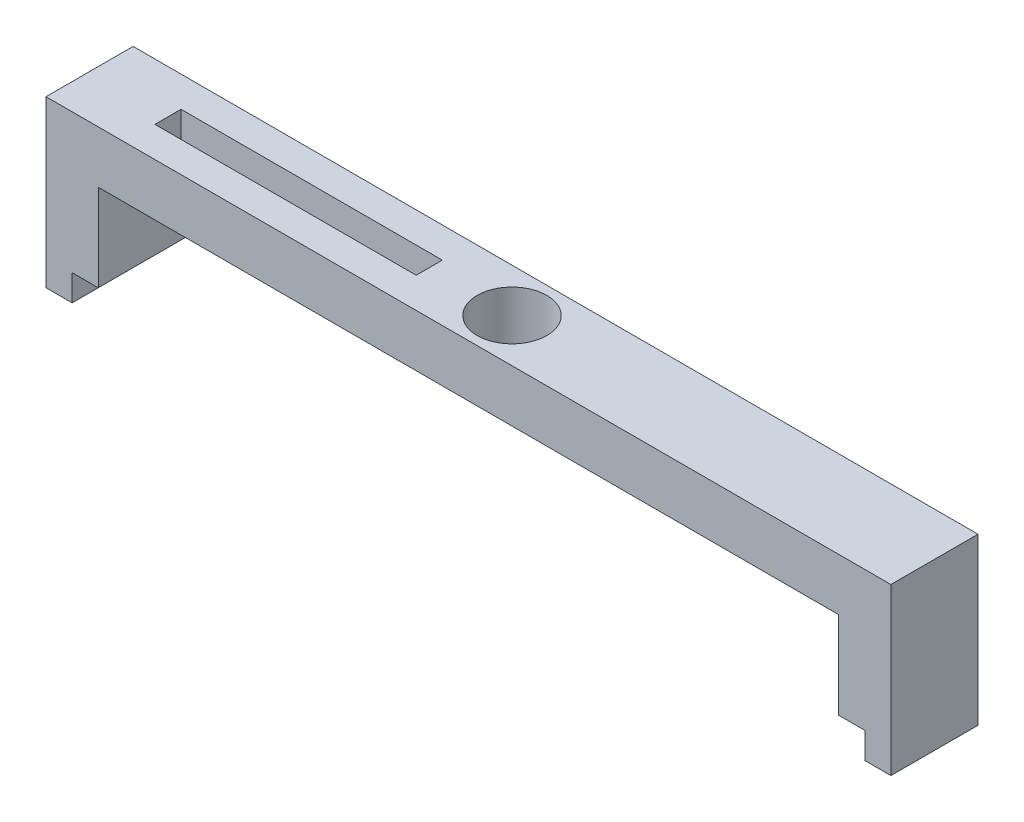
ISO-10303-21;
HEADER;
FILE_DESCRIPTION(('STEP AP214'),'2;1');
FILE_NAME('part.step','',(''),(''),'','','');
FILE_SCHEMA(('AUTOMOTIVE_DESIGN { 1 0 10303 214 1 1 1 1 }'));
ENDSEC;
DATA;
#1=APPLICATION_CONTEXT('core data for automotive mechanical design processes');
#2=APPLICATION_PROTOCOL_DEFINITION('international standard','automotive_design',2000,#1);
#3=PRODUCT_CONTEXT('',#1,'mechanical');
#4=PRODUCT('Part','Part','',(#3));
#5=PRODUCT_RELATED_PRODUCT_CATEGORY('part','',(#4));
#6=PRODUCT_DEFINITION_FORMATION('','',#4);
#7=PRODUCT_DEFINITION_CONTEXT('part definition',#1,'design');
#8=PRODUCT_DEFINITION('design','',#6,#7);
#9=PRODUCT_DEFINITION_SHAPE('','',#8);
#10=(LENGTH_UNIT() NAMED_UNIT(*) SI_UNIT(.MILLI.,.METRE.));
#11=(NAMED_UNIT(*) PLANE_ANGLE_UNIT() SI_UNIT($,.RADIAN.));
#12=(NAMED_UNIT(*) SI_UNIT($,.STERADIAN.) SOLID_ANGLE_UNIT());
#13=UNCERTAINTY_MEASURE_WITH_UNIT(LENGTH_MEASURE(1.E-05),#10,'distance_accuracy_value','');
#14=(GEOMETRIC_REPRESENTATION_CONTEXT(3) GLOBAL_UNCERTAINTY_ASSIGNED_CONTEXT((#13)) GLOBAL_UNIT_ASSIGNED_CONTEXT((#10,
#11,#12)) REPRESENTATION_CONTEXT('',''));
#15=CARTESIAN_POINT('',(0.,0.,0.));
#16=DIRECTION('',(0.,0.,1.));
#17=DIRECTION('',(1.,0.,0.));
#18=AXIS2_PLACEMENT_3D('',#15,#16,#17);
#19=CARTESIAN_POINT('',(-49.4121405750799,-10.,10.));
#20=DIRECTION('',(0.,1.,0.));
#21=DIRECTION('',(0.,0.,1.));
#22=AXIS2_PLACEMENT_3D('',#19,#20,#21);
#23=PLANE('',#22);
#24=DIRECTION('',(1.,0.,0.));
#25=VECTOR('',#24,1.);
#26=CARTESIAN_POINT('',(-49.4121405750799,-10.,0.));
#27=LINE('',#26,#25);
#28=CARTESIAN_POINT('',(-49.4121405750799,-10.,0.));
#29=VERTEX_POINT('',#28);
#30=CARTESIAN_POINT('',(-46.4121405750799,-10.,0.));
#31=VERTEX_POINT('',#30);
#32=EDGE_CURVE('E205',#29,#31,#27,.T.);
#33=ORIENTED_EDGE('',*,*,#32,.T.);
#34=DIRECTION('',(0.,0.,-1.));
#35=VECTOR('',#34,1.);
#36=CARTESIAN_POINT('',(-46.4121405750799,-10.,10.));
#37=LINE('',#36,#35);
#38=CARTESIAN_POINT('',(-46.4121405750799,-10.,10.));
#39=VERTEX_POINT('',#38);
#40=EDGE_CURVE('E11',#39,#31,#37,.T.);
#41=ORIENTED_EDGE('',*,*,#40,.F.);
#42=DIRECTION('',(1.,0.,0.));
#43=VECTOR('',#42,1.);
#44=CARTESIAN_POINT('',(-49.4121405750799,-10.,10.));
#45=LINE('',#44,#43);
#46=CARTESIAN_POINT('',(-49.4121405750799,-10.,10.));
#47=VERTEX_POINT('',#46);
#48=EDGE_CURVE('E206',#47,#39,#45,.T.);
#49=ORIENTED_EDGE('',*,*,#48,.F.);
#50=DIRECTION('',(0.,0.,-1.));
#51=VECTOR('',#50,1.);
#52=CARTESIAN_POINT('',(-49.4121405750799,-10.,10.));
#53=LINE('',#52,#51);
#54=EDGE_CURVE('E244',#47,#29,#53,.T.);
#55=ORIENTED_EDGE('',*,*,#54,.T.);
#56=EDGE_LOOP('',(#33,#41,#49,#55));
#57=FACE_BOUND('',#56,.T.);
#58=ADVANCED_FACE('F39',(#57),#23,.F.);
#59=CARTESIAN_POINT('',(-46.4121405750799,-10.,10.));
#60=DIRECTION('',(-1.,0.,0.));
#61=DIRECTION('',(0.,0.,1.));
#62=AXIS2_PLACEMENT_3D('',#59,#60,#61);
#63=PLANE('',#62);
#64=DIRECTION('',(0.,1.,0.));
#65=VECTOR('',#64,1.);
#66=CARTESIAN_POINT('',(-46.4121405750799,-10.,0.));
#67=LINE('',#66,#65);
#68=CARTESIAN_POINT('',(-46.4121405750799,0.,0.));
#69=VERTEX_POINT('',#68);
#70=EDGE_CURVE('E248',#31,#69,#67,.T.);
#71=ORIENTED_EDGE('',*,*,#70,.T.);
#72=DIRECTION('',(0.,0.,-1.));
#73=VECTOR('',#72,1.);
#74=CARTESIAN_POINT('',(-46.4121405750799,0.,10.));
#75=LINE('',#74,#73);
#76=CARTESIAN_POINT('',(-46.4121405750799,0.,10.));
#77=VERTEX_POINT('',#76);
#78=EDGE_CURVE('E47',#77,#69,#75,.T.);
#79=ORIENTED_EDGE('',*,*,#78,.F.);
#80=DIRECTION('',(0.,1.,0.));
#81=VECTOR('',#80,1.);
#82=CARTESIAN_POINT('',(-46.4121405750799,-10.,10.));
#83=LINE('',#82,#81);
#84=EDGE_CURVE('E210',#39,#77,#83,.T.);
#85=ORIENTED_EDGE('',*,*,#84,.F.);
#86=ORIENTED_EDGE('',*,*,#40,.T.);
#87=EDGE_LOOP('',(#71,#79,#85,#86));
#88=FACE_BOUND('',#87,.T.);
#89=ADVANCED_FACE('F327',(#88),#63,.F.);
#90=CARTESIAN_POINT('',(38.5878594249201,0.,10.));
#91=DIRECTION('',(0.,1.,0.));
#92=DIRECTION('',(0.,0.,1.));
#93=AXIS2_PLACEMENT_3D('',#90,#91,#92);
#94=PLANE('',#93);
#95=CARTESIAN_POINT('',(-3.91214057507986,0.,5.));
#96=DIRECTION('',(0.,1.,0.));
#97=DIRECTION('',(0.,0.,1.));
#98=AXIS2_PLACEMENT_3D('',#95,#96,#97);
#99=CIRCLE('',#98,4.);
#100=CARTESIAN_POINT('',(-3.91214057507986,0.,9.));
#101=VERTEX_POINT('',#100);
#102=EDGE_CURVE('E201',#101,#101,#99,.T.);
#103=ORIENTED_EDGE('',*,*,#102,.T.);
#104=EDGE_LOOP('',(#103));
#105=FACE_BOUND('',#104,.T.);
#106=DIRECTION('',(1.,0.,0.));
#107=VECTOR('',#106,1.);
#108=CARTESIAN_POINT('',(38.5878594249201,0.,6.5));
#109=LINE('',#108,#107);
#110=CARTESIAN_POINT('',(-43.4121405750799,0.,6.5));
#111=VERTEX_POINT('',#110);
#112=CARTESIAN_POINT('',(-13.4121405750799,0.,6.5));
#113=VERTEX_POINT('',#112);
#114=EDGE_CURVE('E193',#111,#113,#109,.T.);
#115=ORIENTED_EDGE('',*,*,#114,.T.);
#116=DIRECTION('',(0.,0.,-1.));
#117=VECTOR('',#116,1.);
#118=CARTESIAN_POINT('',(-13.4121405750799,0.,10.));
#119=LINE('',#118,#117);
#120=CARTESIAN_POINT('',(-13.4121405750799,0.,3.5));
#121=VERTEX_POINT('',#120);
#122=EDGE_CURVE('E197',#113,#121,#119,.T.);
#123=ORIENTED_EDGE('',*,*,#122,.T.);
#124=DIRECTION('',(-1.,0.,0.));
#125=VECTOR('',#124,1.);
#126=CARTESIAN_POINT('',(38.5878594249201,0.,3.5));
#127=LINE('',#126,#125);
#128=CARTESIAN_POINT('',(-43.4121405750799,0.,3.5));
#129=VERTEX_POINT('',#128);
#130=EDGE_CURVE('E188',#121,#129,#127,.T.);
#131=ORIENTED_EDGE('',*,*,#130,.T.);
#132=DIRECTION('',(0.,0.,1.));
#133=VECTOR('',#132,1.);
#134=CARTESIAN_POINT('',(-43.4121405750799,0.,10.));
#135=LINE('',#134,#133);
#136=EDGE_CURVE('E158',#129,#111,#135,.T.);
#137=ORIENTED_EDGE('',*,*,#136,.T.);
#138=EDGE_LOOP('',(#115,#123,#131,#137));
#139=FACE_BOUND('',#138,.T.);
#140=DIRECTION('',(1.,0.,0.));
#141=VECTOR('',#140,1.);
#142=CARTESIAN_POINT('',(38.5878594249201,0.,0.));
#143=LINE('',#142,#141);
#144=CARTESIAN_POINT('',(38.5878594249201,0.,0.));
#145=VERTEX_POINT('',#144);
#146=EDGE_CURVE('E252',#69,#145,#143,.T.);
#147=ORIENTED_EDGE('',*,*,#146,.T.);
#148=DIRECTION('',(0.,0.,-1.));
#149=VECTOR('',#148,1.);
#150=CARTESIAN_POINT('',(38.5878594249201,0.,10.));
#151=LINE('',#150,#149);
#152=CARTESIAN_POINT('',(38.5878594249201,0.,10.));
#153=VERTEX_POINT('',#152);
#154=EDGE_CURVE('E316',#153,#145,#151,.T.);
#155=ORIENTED_EDGE('',*,*,#154,.F.);
#156=DIRECTION('',(1.,0.,0.));
#157=VECTOR('',#156,1.);
#158=CARTESIAN_POINT('',(-46.4121405750799,0.,10.));
#159=LINE('',#158,#157);
#160=EDGE_CURVE('E214',#77,#153,#159,.T.);
#161=ORIENTED_EDGE('',*,*,#160,.F.);
#162=ORIENTED_EDGE('',*,*,#78,.T.);
#163=EDGE_LOOP('',(#147,#155,#161,#162));
#164=FACE_BOUND('',#163,.T.);
#165=ADVANCED_FACE('F324',(#105,#139,#164),#94,.F.);
#166=CARTESIAN_POINT('',(38.5878594249201,-10.,10.));
#167=DIRECTION('',(1.,0.,0.));
#168=DIRECTION('',(0.,0.,-1.));
#169=AXIS2_PLACEMENT_3D('',#166,#167,#168);
#170=PLANE('',#169);
#171=DIRECTION('',(0.,-1.,0.));
#172=VECTOR('',#171,1.);
#173=CARTESIAN_POINT('',(38.5878594249201,-10.,0.));
#174=LINE('',#173,#172);
#175=CARTESIAN_POINT('',(38.5878594249201,-10.,0.));
#176=VERTEX_POINT('',#175);
#177=EDGE_CURVE('E255',#145,#176,#174,.T.);
#178=ORIENTED_EDGE('',*,*,#177,.T.);
#179=DIRECTION('',(0.,0.,-1.));
#180=VECTOR('',#179,1.);
#181=CARTESIAN_POINT('',(38.5878594249201,-10.,10.));
#182=LINE('',#181,#180);
#183=CARTESIAN_POINT('',(38.5878594249201,-10.,10.));
#184=VERTEX_POINT('',#183);
#185=EDGE_CURVE('E312',#184,#176,#182,.T.);
#186=ORIENTED_EDGE('',*,*,#185,.F.);
#187=DIRECTION('',(0.,-1.,0.));
#188=VECTOR('',#187,1.);
#189=CARTESIAN_POINT('',(38.5878594249201,-10.,10.));
#190=LINE('',#189,#188);
#191=EDGE_CURVE('E217',#153,#184,#190,.T.);
#192=ORIENTED_EDGE('',*,*,#191,.F.);
#193=ORIENTED_EDGE('',*,*,#154,.T.);
#194=EDGE_LOOP('',(#178,#186,#192,#193));
#195=FACE_BOUND('',#194,.T.);
#196=ADVANCED_FACE('F338',(#195),#170,.F.);
#197=CARTESIAN_POINT('',(38.5878594249201,-10.,10.));
#198=DIRECTION('',(0.,1.,0.));
#199=DIRECTION('',(0.,0.,1.));
#200=AXIS2_PLACEMENT_3D('',#197,#198,#199);
#201=PLANE('',#200);
#202=DIRECTION('',(1.,0.,0.));
#203=VECTOR('',#202,1.);
#204=CARTESIAN_POINT('',(38.5878594249201,-10.,0.));
#205=LINE('',#204,#203);
#206=CARTESIAN_POINT('',(41.5878594249201,-10.,0.));
#207=VERTEX_POINT('',#206);
#208=EDGE_CURVE('E258',#176,#207,#205,.T.);
#209=ORIENTED_EDGE('',*,*,#208,.T.);
#210=DIRECTION('',(0.,0.,-1.));
#211=VECTOR('',#210,1.);
#212=CARTESIAN_POINT('',(41.5878594249201,-10.,10.));
#213=LINE('',#212,#211);
#214=CARTESIAN_POINT('',(41.5878594249201,-10.,10.));
#215=VERTEX_POINT('',#214);
#216=EDGE_CURVE('E308',#215,#207,#213,.T.);
#217=ORIENTED_EDGE('',*,*,#216,.F.);
#218=DIRECTION('',(1.,0.,0.));
#219=VECTOR('',#218,1.);
#220=CARTESIAN_POINT('',(38.5878594249201,-10.,10.));
#221=LINE('',#220,#219);
#222=EDGE_CURVE('E220',#184,#215,#221,.T.);
#223=ORIENTED_EDGE('',*,*,#222,.F.);
#224=ORIENTED_EDGE('',*,*,#185,.T.);
#225=EDGE_LOOP('',(#209,#217,#223,#224));
#226=FACE_BOUND('',#225,.T.);
#227=ADVANCED_FACE('F342',(#226),#201,.F.);
#228=CARTESIAN_POINT('',(41.5878594249201,-10.,10.));
#229=DIRECTION('',(1.,0.,0.));
#230=DIRECTION('',(0.,0.,-1.));
#231=AXIS2_PLACEMENT_3D('',#228,#229,#230);
#232=PLANE('',#231);
#233=DIRECTION('',(0.,-1.,0.));
#234=VECTOR('',#233,1.);
#235=CARTESIAN_POINT('',(41.5878594249201,-10.,0.));
#236=LINE('',#235,#234);
#237=CARTESIAN_POINT('',(41.5878594249201,-13.,0.));
#238=VERTEX_POINT('',#237);
#239=EDGE_CURVE('E261',#207,#238,#236,.T.);
#240=ORIENTED_EDGE('',*,*,#239,.T.);
#241=DIRECTION('',(0.,0.,-1.));
#242=VECTOR('',#241,1.);
#243=CARTESIAN_POINT('',(41.5878594249201,-13.,10.));
#244=LINE('',#243,#242);
#245=CARTESIAN_POINT('',(41.5878594249201,-13.,10.));
#246=VERTEX_POINT('',#245);
#247=EDGE_CURVE('E304',#246,#238,#244,.T.);
#248=ORIENTED_EDGE('',*,*,#247,.F.);
#249=DIRECTION('',(0.,-1.,0.));
#250=VECTOR('',#249,1.);
#251=CARTESIAN_POINT('',(41.5878594249201,-10.,10.));
#252=LINE('',#251,#250);
#253=EDGE_CURVE('E223',#215,#246,#252,.T.);
#254=ORIENTED_EDGE('',*,*,#253,.F.);
#255=ORIENTED_EDGE('',*,*,#216,.T.);
#256=EDGE_LOOP('',(#240,#248,#254,#255));
#257=FACE_BOUND('',#256,.T.);
#258=ADVANCED_FACE('F378',(#257),#232,.F.);
#259=CARTESIAN_POINT('',(41.5878594249201,-13.,10.));
#260=DIRECTION('',(0.,1.,0.));
#261=DIRECTION('',(0.,0.,1.));
#262=AXIS2_PLACEMENT_3D('',#259,#260,#261);
#263=PLANE('',#262);
#264=DIRECTION('',(1.,0.,0.));
#265=VECTOR('',#264,1.);
#266=CARTESIAN_POINT('',(41.5878594249201,-13.,0.));
#267=LINE('',#266,#265);
#268=CARTESIAN_POINT('',(44.5878594249201,-13.,0.));
#269=VERTEX_POINT('',#268);
#270=EDGE_CURVE('E264',#238,#269,#267,.T.);
#271=ORIENTED_EDGE('',*,*,#270,.T.);
#272=DIRECTION('',(0.,0.,-1.));
#273=VECTOR('',#272,1.);
#274=CARTESIAN_POINT('',(44.5878594249201,-13.,10.));
#275=LINE('',#274,#273);
#276=CARTESIAN_POINT('',(44.5878594249201,-13.,10.));
#277=VERTEX_POINT('',#276);
#278=EDGE_CURVE('E300',#277,#269,#275,.T.);
#279=ORIENTED_EDGE('',*,*,#278,.F.);
#280=DIRECTION('',(1.,0.,0.));
#281=VECTOR('',#280,1.);
#282=CARTESIAN_POINT('',(41.5878594249201,-13.,10.));
#283=LINE('',#282,#281);
#284=EDGE_CURVE('E226',#246,#277,#283,.T.);
#285=ORIENTED_EDGE('',*,*,#284,.F.);
#286=ORIENTED_EDGE('',*,*,#247,.T.);
#287=EDGE_LOOP('',(#271,#279,#285,#286));
#288=FACE_BOUND('',#287,.T.);
#289=ADVANCED_FACE('F376',(#288),#263,.F.);
#290=CARTESIAN_POINT('',(44.5878594249201,-13.,10.));
#291=DIRECTION('',(-1.,0.,0.));
#292=DIRECTION('',(0.,0.,1.));
#293=AXIS2_PLACEMENT_3D('',#290,#291,#292);
#294=PLANE('',#293);
#295=DIRECTION('',(0.,1.,0.));
#296=VECTOR('',#295,1.);
#297=CARTESIAN_POINT('',(44.5878594249201,-13.,0.));
#298=LINE('',#297,#296);
#299=CARTESIAN_POINT('',(44.5878594249201,6.,0.));
#300=VERTEX_POINT('',#299);
#301=EDGE_CURVE('E267',#269,#300,#298,.T.);
#302=ORIENTED_EDGE('',*,*,#301,.T.);
#303=DIRECTION('',(0.,0.,-1.));
#304=VECTOR('',#303,1.);
#305=CARTESIAN_POINT('',(44.5878594249201,6.,10.));
#306=LINE('',#305,#304);
#307=CARTESIAN_POINT('',(44.5878594249201,6.,10.));
#308=VERTEX_POINT('',#307);
#309=EDGE_CURVE('E296',#308,#300,#306,.T.);
#310=ORIENTED_EDGE('',*,*,#309,.F.);
#311=DIRECTION('',(0.,1.,0.));
#312=VECTOR('',#311,1.);
#313=CARTESIAN_POINT('',(44.5878594249201,-13.,10.));
#314=LINE('',#313,#312);
#315=EDGE_CURVE('E229',#277,#308,#314,.T.);
#316=ORIENTED_EDGE('',*,*,#315,.F.);
#317=ORIENTED_EDGE('',*,*,#278,.T.);
#318=EDGE_LOOP('',(#302,#310,#316,#317));
#319=FACE_BOUND('',#318,.T.);
#320=ADVANCED_FACE('F371',(#319),#294,.F.);
#321=CARTESIAN_POINT('',(44.5878594249201,6.,10.));
#322=DIRECTION('',(0.,-1.,0.));
#323=DIRECTION('',(1.,0.,0.));
#324=AXIS2_PLACEMENT_3D('',#321,#322,#323);
#325=PLANE('',#324);
#326=CARTESIAN_POINT('',(-3.91214057507986,5.99999999999999,5.));
#327=DIRECTION('',(0.,1.,0.));
#328=DIRECTION('',(-1.,0.,0.));
#329=AXIS2_PLACEMENT_3D('',#326,#327,#328);
#330=CIRCLE('',#329,4.);
#331=CARTESIAN_POINT('',(-7.91214057507986,5.99999999999999,5.));
#332=VERTEX_POINT('',#331);
#333=EDGE_CURVE('E183',#332,#332,#330,.T.);
#334=ORIENTED_EDGE('',*,*,#333,.F.);
#335=EDGE_LOOP('',(#334));
#336=FACE_BOUND('',#335,.T.);
#337=DIRECTION('',(-1.,0.,0.));
#338=VECTOR('',#337,1.);
#339=CARTESIAN_POINT('',(-43.4121405750799,5.99999999999999,3.5));
#340=LINE('',#339,#338);
#341=CARTESIAN_POINT('',(-13.4121405750799,5.99999999999999,3.5));
#342=VERTEX_POINT('',#341);
#343=CARTESIAN_POINT('',(-43.4121405750799,5.99999999999999,3.5));
#344=VERTEX_POINT('',#343);
#345=EDGE_CURVE('E165',#342,#344,#340,.T.);
#346=ORIENTED_EDGE('',*,*,#345,.F.);
#347=DIRECTION('',(0.,0.,-1.));
#348=VECTOR('',#347,1.);
#349=CARTESIAN_POINT('',(-13.4121405750799,5.99999999999999,6.5));
#350=LINE('',#349,#348);
#351=CARTESIAN_POINT('',(-13.4121405750799,5.99999999999999,6.5));
#352=VERTEX_POINT('',#351);
#353=EDGE_CURVE('E62',#352,#342,#350,.T.);
#354=ORIENTED_EDGE('',*,*,#353,.F.);
#355=DIRECTION('',(1.,0.,0.));
#356=VECTOR('',#355,1.);
#357=CARTESIAN_POINT('',(-43.4121405750799,5.99999999999999,6.5));
#358=LINE('',#357,#356);
#359=CARTESIAN_POINT('',(-43.4121405750799,5.99999999999999,6.5));
#360=VERTEX_POINT('',#359);
#361=EDGE_CURVE('E173',#360,#352,#358,.T.);
#362=ORIENTED_EDGE('',*,*,#361,.F.);
#363=DIRECTION('',(0.,0.,1.));
#364=VECTOR('',#363,1.);
#365=CARTESIAN_POINT('',(-43.4121405750799,5.99999999999999,6.5));
#366=LINE('',#365,#364);
#367=EDGE_CURVE('E155',#344,#360,#366,.T.);
#368=ORIENTED_EDGE('',*,*,#367,.F.);
#369=EDGE_LOOP('',(#346,#354,#362,#368));
#370=FACE_BOUND('',#369,.T.);
#371=DIRECTION('',(-1.,0.,0.));
#372=VECTOR('',#371,1.);
#373=CARTESIAN_POINT('',(44.5878594249201,6.,0.));
#374=LINE('',#373,#372);
#375=CARTESIAN_POINT('',(-52.4121405750799,5.99999999999999,0.));
#376=VERTEX_POINT('',#375);
#377=EDGE_CURVE('E270',#300,#376,#374,.T.);
#378=ORIENTED_EDGE('',*,*,#377,.T.);
#379=DIRECTION('',(0.,0.,-1.));
#380=VECTOR('',#379,1.);
#381=CARTESIAN_POINT('',(-52.4121405750799,5.99999999999999,10.));
#382=LINE('',#381,#380);
#383=CARTESIAN_POINT('',(-52.4121405750799,5.99999999999999,10.));
#384=VERTEX_POINT('',#383);
#385=EDGE_CURVE('E292',#384,#376,#382,.T.);
#386=ORIENTED_EDGE('',*,*,#385,.F.);
#387=DIRECTION('',(-1.,0.,0.));
#388=VECTOR('',#387,1.);
#389=CARTESIAN_POINT('',(44.5878594249201,6.,10.));
#390=LINE('',#389,#388);
#391=EDGE_CURVE('E232',#308,#384,#390,.T.);
#392=ORIENTED_EDGE('',*,*,#391,.F.);
#393=ORIENTED_EDGE('',*,*,#309,.T.);
#394=EDGE_LOOP('',(#378,#386,#392,#393));
#395=FACE_BOUND('',#394,.T.);
#396=ADVANCED_FACE('F170',(#336,#370,#395),#325,.F.);
#397=CARTESIAN_POINT('',(-52.4121405750799,5.99999999999999,10.));
#398=DIRECTION('',(1.,0.,0.));
#399=DIRECTION('',(0.,0.,-1.));
#400=AXIS2_PLACEMENT_3D('',#397,#398,#399);
#401=PLANE('',#400);
#402=DIRECTION('',(0.,-1.,0.));
#403=VECTOR('',#402,1.);
#404=CARTESIAN_POINT('',(-52.4121405750799,5.99999999999999,0.));
#405=LINE('',#404,#403);
#406=CARTESIAN_POINT('',(-52.4121405750799,-13.,0.));
#407=VERTEX_POINT('',#406);
#408=EDGE_CURVE('E273',#376,#407,#405,.T.);
#409=ORIENTED_EDGE('',*,*,#408,.T.);
#410=DIRECTION('',(0.,0.,-1.));
#411=VECTOR('',#410,1.);
#412=CARTESIAN_POINT('',(-52.4121405750799,-13.,10.));
#413=LINE('',#412,#411);
#414=CARTESIAN_POINT('',(-52.4121405750799,-13.,10.));
#415=VERTEX_POINT('',#414);
#416=EDGE_CURVE('E288',#415,#407,#413,.T.);
#417=ORIENTED_EDGE('',*,*,#416,.F.);
#418=DIRECTION('',(0.,-1.,0.));
#419=VECTOR('',#418,1.);
#420=CARTESIAN_POINT('',(-52.4121405750799,5.99999999999999,10.));
#421=LINE('',#420,#419);
#422=EDGE_CURVE('E235',#384,#415,#421,.T.);
#423=ORIENTED_EDGE('',*,*,#422,.F.);
#424=ORIENTED_EDGE('',*,*,#385,.T.);
#425=EDGE_LOOP('',(#409,#417,#423,#424));
#426=FACE_BOUND('',#425,.T.);
#427=ADVANCED_FACE('F364',(#426),#401,.F.);
#428=CARTESIAN_POINT('',(-52.4121405750799,-13.,10.));
#429=DIRECTION('',(0.,1.,0.));
#430=DIRECTION('',(0.,0.,1.));
#431=AXIS2_PLACEMENT_3D('',#428,#429,#430);
#432=PLANE('',#431);
#433=DIRECTION('',(1.,0.,0.));
#434=VECTOR('',#433,1.);
#435=CARTESIAN_POINT('',(-52.4121405750799,-13.,0.));
#436=LINE('',#435,#434);
#437=CARTESIAN_POINT('',(-49.4121405750799,-13.,0.));
#438=VERTEX_POINT('',#437);
#439=EDGE_CURVE('E276',#407,#438,#436,.T.);
#440=ORIENTED_EDGE('',*,*,#439,.T.);
#441=DIRECTION('',(0.,0.,-1.));
#442=VECTOR('',#441,1.);
#443=CARTESIAN_POINT('',(-49.4121405750799,-13.,10.));
#444=LINE('',#443,#442);
#445=CARTESIAN_POINT('',(-49.4121405750799,-13.,10.));
#446=VERTEX_POINT('',#445);
#447=EDGE_CURVE('E284',#446,#438,#444,.T.);
#448=ORIENTED_EDGE('',*,*,#447,.F.);
#449=DIRECTION('',(1.,0.,0.));
#450=VECTOR('',#449,1.);
#451=CARTESIAN_POINT('',(-52.4121405750799,-13.,10.));
#452=LINE('',#451,#450);
#453=EDGE_CURVE('E238',#415,#446,#452,.T.);
#454=ORIENTED_EDGE('',*,*,#453,.F.);
#455=ORIENTED_EDGE('',*,*,#416,.T.);
#456=EDGE_LOOP('',(#440,#448,#454,#455));
#457=FACE_BOUND('',#456,.T.);
#458=ADVANCED_FACE('F359',(#457),#432,.F.);
#459=CARTESIAN_POINT('',(-49.4121405750799,-13.,10.));
#460=DIRECTION('',(-1.,0.,0.));
#461=DIRECTION('',(0.,0.,1.));
#462=AXIS2_PLACEMENT_3D('',#459,#460,#461);
#463=PLANE('',#462);
#464=DIRECTION('',(0.,1.,0.));
#465=VECTOR('',#464,1.);
#466=CARTESIAN_POINT('',(-49.4121405750799,-13.,0.));
#467=LINE('',#466,#465);
#468=EDGE_CURVE('E211',#438,#29,#467,.T.);
#469=ORIENTED_EDGE('',*,*,#468,.T.);
#470=ORIENTED_EDGE('',*,*,#54,.F.);
#471=DIRECTION('',(0.,1.,0.));
#472=VECTOR('',#471,1.);
#473=CARTESIAN_POINT('',(-49.4121405750799,-13.,10.));
#474=LINE('',#473,#472);
#475=EDGE_CURVE('E241',#446,#47,#474,.T.);
#476=ORIENTED_EDGE('',*,*,#475,.F.);
#477=ORIENTED_EDGE('',*,*,#447,.T.);
#478=EDGE_LOOP('',(#469,#470,#476,#477));
#479=FACE_BOUND('',#478,.T.);
#480=ADVANCED_FACE('F353',(#479),#463,.F.);
#481=CARTESIAN_POINT('',(0.,0.,10.));
#482=DIRECTION('',(0.,0.,1.));
#483=DIRECTION('',(1.,0.,0.));
#484=AXIS2_PLACEMENT_3D('',#481,#482,#483);
#485=PLANE('',#484);
#486=ORIENTED_EDGE('',*,*,#48,.T.);
#487=ORIENTED_EDGE('',*,*,#84,.T.);
#488=ORIENTED_EDGE('',*,*,#160,.T.);
#489=ORIENTED_EDGE('',*,*,#191,.T.);
#490=ORIENTED_EDGE('',*,*,#222,.T.);
#491=ORIENTED_EDGE('',*,*,#253,.T.);
#492=ORIENTED_EDGE('',*,*,#284,.T.);
#493=ORIENTED_EDGE('',*,*,#315,.T.);
#494=ORIENTED_EDGE('',*,*,#391,.T.);
#495=ORIENTED_EDGE('',*,*,#422,.T.);
#496=ORIENTED_EDGE('',*,*,#453,.T.);
#497=ORIENTED_EDGE('',*,*,#475,.T.);
#498=EDGE_LOOP('',(#486,#487,#488,#489,#490,#491,#492,#493,#494,#495,#496,#497));
#499=FACE_BOUND('',#498,.T.);
#500=ADVANCED_FACE('F346',(#499),#485,.T.);
#501=CARTESIAN_POINT('',(0.,0.,0.));
#502=DIRECTION('',(0.,0.,1.));
#503=DIRECTION('',(1.,0.,0.));
#504=AXIS2_PLACEMENT_3D('',#501,#502,#503);
#505=PLANE('',#504);
#506=ORIENTED_EDGE('',*,*,#32,.F.);
#507=ORIENTED_EDGE('',*,*,#468,.F.);
#508=ORIENTED_EDGE('',*,*,#439,.F.);
#509=ORIENTED_EDGE('',*,*,#408,.F.);
#510=ORIENTED_EDGE('',*,*,#377,.F.);
#511=ORIENTED_EDGE('',*,*,#301,.F.);
#512=ORIENTED_EDGE('',*,*,#270,.F.);
#513=ORIENTED_EDGE('',*,*,#239,.F.);
#514=ORIENTED_EDGE('',*,*,#208,.F.);
#515=ORIENTED_EDGE('',*,*,#177,.F.);
#516=ORIENTED_EDGE('',*,*,#146,.F.);
#517=ORIENTED_EDGE('',*,*,#70,.F.);
#518=EDGE_LOOP('',(#506,#507,#508,#509,#510,#511,#512,#513,#514,#515,#516,#517));
#519=FACE_BOUND('',#518,.T.);
#520=ADVANCED_FACE('F331',(#519),#505,.F.);
#521=CARTESIAN_POINT('',(-13.4121405750799,-4.00000000000001,6.5));
#522=DIRECTION('',(1.,0.,0.));
#523=DIRECTION('',(0.,1.,0.));
#524=AXIS2_PLACEMENT_3D('',#521,#522,#523);
#525=PLANE('',#524);
#526=DIRECTION('',(0.,1.,0.));
#527=VECTOR('',#526,1.);
#528=CARTESIAN_POINT('',(-13.4121405750799,-4.00000000000001,6.5));
#529=LINE('',#528,#527);
#530=EDGE_CURVE('E180',#113,#352,#529,.T.);
#531=ORIENTED_EDGE('',*,*,#530,.T.);
#532=ORIENTED_EDGE('',*,*,#353,.T.);
#533=DIRECTION('',(0.,1.,0.));
#534=VECTOR('',#533,1.);
#535=CARTESIAN_POINT('',(-13.4121405750799,-4.00000000000001,3.5));
#536=LINE('',#535,#534);
#537=EDGE_CURVE('E162',#121,#342,#536,.T.);
#538=ORIENTED_EDGE('',*,*,#537,.F.);
#539=ORIENTED_EDGE('',*,*,#122,.F.);
#540=EDGE_LOOP('',(#531,#532,#538,#539));
#541=FACE_BOUND('',#540,.T.);
#542=ADVANCED_FACE('F466',(#541),#525,.F.);
#543=CARTESIAN_POINT('',(-43.4121405750799,-4.00000000000001,6.5));
#544=DIRECTION('',(0.,0.,1.));
#545=DIRECTION('',(1.,0.,0.));
#546=AXIS2_PLACEMENT_3D('',#543,#544,#545);
#547=PLANE('',#546);
#548=DIRECTION('',(0.,1.,0.));
#549=VECTOR('',#548,1.);
#550=CARTESIAN_POINT('',(-43.4121405750799,-4.00000000000001,6.5));
#551=LINE('',#550,#549);
#552=EDGE_CURVE('E161',#111,#360,#551,.T.);
#553=ORIENTED_EDGE('',*,*,#552,.T.);
#554=ORIENTED_EDGE('',*,*,#361,.T.);
#555=ORIENTED_EDGE('',*,*,#530,.F.);
#556=ORIENTED_EDGE('',*,*,#114,.F.);
#557=EDGE_LOOP('',(#553,#554,#555,#556));
#558=FACE_BOUND('',#557,.T.);
#559=ADVANCED_FACE('F488',(#558),#547,.F.);
#560=CARTESIAN_POINT('',(-43.4121405750799,-4.00000000000001,6.5));
#561=DIRECTION('',(-1.,0.,0.));
#562=DIRECTION('',(0.,-1.,0.));
#563=AXIS2_PLACEMENT_3D('',#560,#561,#562);
#564=PLANE('',#563);
#565=DIRECTION('',(0.,1.,0.));
#566=VECTOR('',#565,1.);
#567=CARTESIAN_POINT('',(-43.4121405750799,-4.00000000000001,3.5));
#568=LINE('',#567,#566);
#569=EDGE_CURVE('E54',#129,#344,#568,.T.);
#570=ORIENTED_EDGE('',*,*,#569,.T.);
#571=ORIENTED_EDGE('',*,*,#367,.T.);
#572=ORIENTED_EDGE('',*,*,#552,.F.);
#573=ORIENTED_EDGE('',*,*,#136,.F.);
#574=EDGE_LOOP('',(#570,#571,#572,#573));
#575=FACE_BOUND('',#574,.T.);
#576=ADVANCED_FACE('F152',(#575),#564,.F.);
#577=CARTESIAN_POINT('',(-43.4121405750799,-4.00000000000001,3.5));
#578=DIRECTION('',(0.,0.,-1.));
#579=DIRECTION('',(-1.,0.,0.));
#580=AXIS2_PLACEMENT_3D('',#577,#578,#579);
#581=PLANE('',#580);
#582=ORIENTED_EDGE('',*,*,#537,.T.);
#583=ORIENTED_EDGE('',*,*,#345,.T.);
#584=ORIENTED_EDGE('',*,*,#569,.F.);
#585=ORIENTED_EDGE('',*,*,#130,.F.);
#586=EDGE_LOOP('',(#582,#583,#584,#585));
#587=FACE_BOUND('',#586,.T.);
#588=ADVANCED_FACE('F166',(#587),#581,.F.);
#589=CARTESIAN_POINT('',(-3.91214057507986,-4.00000000000001,5.));
#590=DIRECTION('',(0.,1.,0.));
#591=DIRECTION('',(-1.,0.,0.));
#592=AXIS2_PLACEMENT_3D('',#589,#590,#591);
#593=CYLINDRICAL_SURFACE('',#592,4.);
#594=ORIENTED_EDGE('',*,*,#333,.T.);
#595=EDGE_LOOP('',(#594));
#596=FACE_BOUND('',#595,.T.);
#597=ORIENTED_EDGE('',*,*,#102,.F.);
#598=EDGE_LOOP('',(#597));
#599=FACE_BOUND('',#598,.T.);
#600=ADVANCED_FACE('F514',(#596,#599),#593,.F.);
#601=CLOSED_SHELL('',(#58,#89,#165,#196,#227,#258,#289,#320,#396,#427,#458,#480,#500,#520,#542,
#559,#576,#588,#600));
#602=MANIFOLD_SOLID_BREP('B2',#601);
#603=ADVANCED_BREP_SHAPE_REPRESENTATION('',(#18,#602),#14);
#604=SHAPE_DEFINITION_REPRESENTATION(#9,#603);
ENDSEC;
END-ISO-10303-21;
